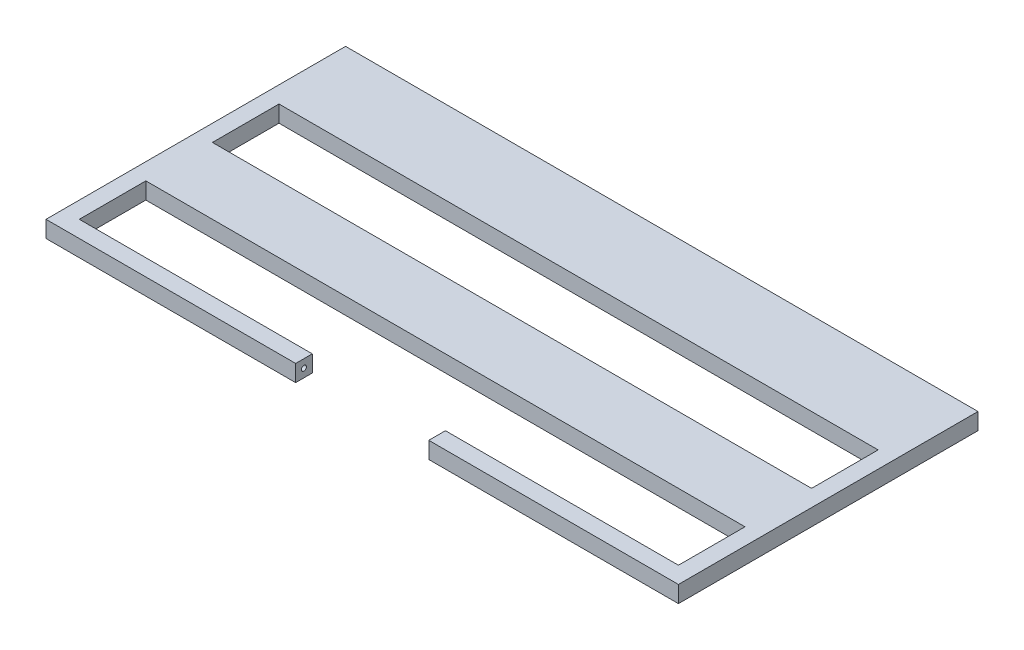
ISO-10303-21;
HEADER;
FILE_DESCRIPTION(('STEP AP214'),'2;1');
FILE_NAME('part.step','',(''),(''),'','','');
FILE_SCHEMA(('AUTOMOTIVE_DESIGN { 1 0 10303 214 1 1 1 1 }'));
ENDSEC;
DATA;
#1=APPLICATION_CONTEXT('core data for automotive mechanical design processes');
#2=APPLICATION_PROTOCOL_DEFINITION('international standard','automotive_design',2000,#1);
#3=PRODUCT_CONTEXT('',#1,'mechanical');
#4=PRODUCT('Part','Part','',(#3));
#5=PRODUCT_RELATED_PRODUCT_CATEGORY('part','',(#4));
#6=PRODUCT_DEFINITION_FORMATION('','',#4);
#7=PRODUCT_DEFINITION_CONTEXT('part definition',#1,'design');
#8=PRODUCT_DEFINITION('design','',#6,#7);
#9=PRODUCT_DEFINITION_SHAPE('','',#8);
#10=(LENGTH_UNIT() NAMED_UNIT(*) SI_UNIT(.MILLI.,.METRE.));
#11=(NAMED_UNIT(*) PLANE_ANGLE_UNIT() SI_UNIT($,.RADIAN.));
#12=(NAMED_UNIT(*) SI_UNIT($,.STERADIAN.) SOLID_ANGLE_UNIT());
#13=UNCERTAINTY_MEASURE_WITH_UNIT(LENGTH_MEASURE(1.E-05),#10,'distance_accuracy_value','');
#14=(GEOMETRIC_REPRESENTATION_CONTEXT(3) GLOBAL_UNCERTAINTY_ASSIGNED_CONTEXT((#13)) GLOBAL_UNIT_ASSIGNED_CONTEXT((#10,
#11,#12)) REPRESENTATION_CONTEXT('',''));
#15=CARTESIAN_POINT('',(0.,0.,0.));
#16=DIRECTION('',(0.,0.,1.));
#17=DIRECTION('',(1.,0.,0.));
#18=AXIS2_PLACEMENT_3D('',#15,#16,#17);
#19=CARTESIAN_POINT('',(0.,25.,475.));
#20=DIRECTION('',(0.,0.,-1.));
#21=DIRECTION('',(-1.,0.,0.));
#22=AXIS2_PLACEMENT_3D('',#19,#20,#21);
#23=PLANE('',#22);
#24=DIRECTION('',(1.,0.,0.));
#25=VECTOR('',#24,1.);
#26=CARTESIAN_POINT('',(0.,0.,475.));
#27=LINE('',#26,#25);
#28=CARTESIAN_POINT('',(-450.,0.,475.));
#29=VERTEX_POINT('',#28);
#30=CARTESIAN_POINT('',(450.,0.,475.));
#31=VERTEX_POINT('',#30);
#32=EDGE_CURVE('E401',#29,#31,#27,.T.);
#33=ORIENTED_EDGE('',*,*,#32,.T.);
#34=DIRECTION('',(0.,-1.,0.));
#35=VECTOR('',#34,1.);
#36=CARTESIAN_POINT('',(450.,25.,475.));
#37=LINE('',#36,#35);
#38=CARTESIAN_POINT('',(450.,25.,475.));
#39=VERTEX_POINT('',#38);
#40=EDGE_CURVE('E240',#39,#31,#37,.T.);
#41=ORIENTED_EDGE('',*,*,#40,.F.);
#42=DIRECTION('',(1.,0.,0.));
#43=VECTOR('',#42,1.);
#44=CARTESIAN_POINT('',(0.,25.,475.));
#45=LINE('',#44,#43);
#46=CARTESIAN_POINT('',(-450.,25.,475.));
#47=VERTEX_POINT('',#46);
#48=EDGE_CURVE('E469',#47,#39,#45,.T.);
#49=ORIENTED_EDGE('',*,*,#48,.F.);
#50=DIRECTION('',(0.,-1.,0.));
#51=VECTOR('',#50,1.);
#52=CARTESIAN_POINT('',(-450.,25.,475.));
#53=LINE('',#52,#51);
#54=EDGE_CURVE('E12',#47,#29,#53,.T.);
#55=ORIENTED_EDGE('',*,*,#54,.T.);
#56=EDGE_LOOP('',(#33,#41,#49,#55));
#57=FACE_BOUND('',#56,.T.);
#58=ADVANCED_FACE('F231',(#57),#23,.F.);
#59=CARTESIAN_POINT('',(0.,25.,375.));
#60=DIRECTION('',(0.,0.,-1.));
#61=DIRECTION('',(-1.,0.,0.));
#62=AXIS2_PLACEMENT_3D('',#59,#60,#61);
#63=PLANE('',#62);
#64=DIRECTION('',(1.,0.,0.));
#65=VECTOR('',#64,1.);
#66=CARTESIAN_POINT('',(0.,0.,375.));
#67=LINE('',#66,#65);
#68=CARTESIAN_POINT('',(-450.,0.,375.));
#69=VERTEX_POINT('',#68);
#70=CARTESIAN_POINT('',(450.,0.,375.));
#71=VERTEX_POINT('',#70);
#72=EDGE_CURVE('E473',#69,#71,#67,.T.);
#73=ORIENTED_EDGE('',*,*,#72,.F.);
#74=DIRECTION('',(0.,-1.,0.));
#75=VECTOR('',#74,1.);
#76=CARTESIAN_POINT('',(-450.,25.,375.));
#77=LINE('',#76,#75);
#78=CARTESIAN_POINT('',(-450.,25.,375.));
#79=VERTEX_POINT('',#78);
#80=EDGE_CURVE('E257',#79,#69,#77,.T.);
#81=ORIENTED_EDGE('',*,*,#80,.F.);
#82=DIRECTION('',(1.,0.,0.));
#83=VECTOR('',#82,1.);
#84=CARTESIAN_POINT('',(0.,25.,375.));
#85=LINE('',#84,#83);
#86=CARTESIAN_POINT('',(450.,25.,375.));
#87=VERTEX_POINT('',#86);
#88=EDGE_CURVE('E472',#79,#87,#85,.T.);
#89=ORIENTED_EDGE('',*,*,#88,.T.);
#90=DIRECTION('',(0.,-1.,0.));
#91=VECTOR('',#90,1.);
#92=CARTESIAN_POINT('',(450.,25.,375.));
#93=LINE('',#92,#91);
#94=EDGE_CURVE('E480',#87,#71,#93,.T.);
#95=ORIENTED_EDGE('',*,*,#94,.T.);
#96=EDGE_LOOP('',(#73,#81,#89,#95));
#97=FACE_BOUND('',#96,.T.);
#98=ADVANCED_FACE('F515',(#97),#63,.T.);
#99=CARTESIAN_POINT('',(0.,0.,0.));
#100=DIRECTION('',(0.,1.,0.));
#101=DIRECTION('',(0.,0.,1.));
#102=AXIS2_PLACEMENT_3D('',#99,#100,#101);
#103=PLANE('',#102);
#104=DIRECTION('',(0.,0.,-1.));
#105=VECTOR('',#104,1.);
#106=CARTESIAN_POINT('',(-450.,0.,575.));
#107=LINE('',#106,#105);
#108=CARTESIAN_POINT('',(-450.,0.,275.));
#109=VERTEX_POINT('',#108);
#110=EDGE_CURVE('E429',#69,#109,#107,.T.);
#111=ORIENTED_EDGE('',*,*,#110,.F.);
#112=ORIENTED_EDGE('',*,*,#72,.T.);
#113=DIRECTION('',(0.,0.,-1.));
#114=VECTOR('',#113,1.);
#115=CARTESIAN_POINT('',(450.,0.,575.));
#116=LINE('',#115,#114);
#117=CARTESIAN_POINT('',(450.,0.,275.));
#118=VERTEX_POINT('',#117);
#119=EDGE_CURVE('E433',#71,#118,#116,.T.);
#120=ORIENTED_EDGE('',*,*,#119,.T.);
#121=DIRECTION('',(1.,0.,0.));
#122=VECTOR('',#121,1.);
#123=CARTESIAN_POINT('',(0.,0.,275.));
#124=LINE('',#123,#122);
#125=EDGE_CURVE('E385',#109,#118,#124,.T.);
#126=ORIENTED_EDGE('',*,*,#125,.F.);
#127=EDGE_LOOP('',(#111,#112,#120,#126));
#128=FACE_BOUND('',#127,.T.);
#129=DIRECTION('',(0.,0.,-1.));
#130=VECTOR('',#129,1.);
#131=CARTESIAN_POINT('',(-475.,0.,600.));
#132=LINE('',#131,#130);
#133=CARTESIAN_POINT('',(-475.,0.,600.));
#134=VERTEX_POINT('',#133);
#135=CARTESIAN_POINT('',(-475.,0.,150.));
#136=VERTEX_POINT('',#135);
#137=EDGE_CURVE('E353',#134,#136,#132,.T.);
#138=ORIENTED_EDGE('',*,*,#137,.T.);
#139=DIRECTION('',(-1.,0.,0.));
#140=VECTOR('',#139,1.);
#141=CARTESIAN_POINT('',(475.,0.,150.));
#142=LINE('',#141,#140);
#143=CARTESIAN_POINT('',(475.,0.,150.));
#144=VERTEX_POINT('',#143);
#145=EDGE_CURVE('E248',#144,#136,#142,.T.);
#146=ORIENTED_EDGE('',*,*,#145,.F.);
#147=DIRECTION('',(0.,0.,-1.));
#148=VECTOR('',#147,1.);
#149=CARTESIAN_POINT('',(475.,0.,600.));
#150=LINE('',#149,#148);
#151=CARTESIAN_POINT('',(475.,0.,600.));
#152=VERTEX_POINT('',#151);
#153=EDGE_CURVE('E362',#152,#144,#150,.T.);
#154=ORIENTED_EDGE('',*,*,#153,.F.);
#155=DIRECTION('',(1.,0.,0.));
#156=VECTOR('',#155,1.);
#157=CARTESIAN_POINT('',(99.9999999999999,0.,600.));
#158=LINE('',#157,#156);
#159=CARTESIAN_POINT('',(99.9999999999999,0.,600.));
#160=VERTEX_POINT('',#159);
#161=EDGE_CURVE('E367',#160,#152,#158,.T.);
#162=ORIENTED_EDGE('',*,*,#161,.F.);
#163=DIRECTION('',(0.,0.,-1.));
#164=VECTOR('',#163,1.);
#165=CARTESIAN_POINT('',(99.9999999999999,0.,600.));
#166=LINE('',#165,#164);
#167=CARTESIAN_POINT('',(99.9999999999998,0.,575.));
#168=VERTEX_POINT('',#167);
#169=EDGE_CURVE('E440',#160,#168,#166,.T.);
#170=ORIENTED_EDGE('',*,*,#169,.T.);
#171=DIRECTION('',(1.,0.,0.));
#172=VECTOR('',#171,1.);
#173=CARTESIAN_POINT('',(99.9999999999998,0.,575.));
#174=LINE('',#173,#172);
#175=CARTESIAN_POINT('',(450.,0.,575.));
#176=VERTEX_POINT('',#175);
#177=EDGE_CURVE('E437',#168,#176,#174,.T.);
#178=ORIENTED_EDGE('',*,*,#177,.T.);
#179=EDGE_CURVE('E434',#176,#31,#116,.T.);
#180=ORIENTED_EDGE('',*,*,#179,.T.);
#181=ORIENTED_EDGE('',*,*,#32,.F.);
#182=CARTESIAN_POINT('',(-450.,0.,575.));
#183=VERTEX_POINT('',#182);
#184=EDGE_CURVE('E430',#183,#29,#107,.T.);
#185=ORIENTED_EDGE('',*,*,#184,.F.);
#186=DIRECTION('',(1.,0.,0.));
#187=VECTOR('',#186,1.);
#188=CARTESIAN_POINT('',(-450.,0.,575.));
#189=LINE('',#188,#187);
#190=CARTESIAN_POINT('',(-100.,0.,575.));
#191=VERTEX_POINT('',#190);
#192=EDGE_CURVE('E427',#183,#191,#189,.T.);
#193=ORIENTED_EDGE('',*,*,#192,.T.);
#194=DIRECTION('',(0.,0.,-1.));
#195=VECTOR('',#194,1.);
#196=CARTESIAN_POINT('',(-100.,0.,600.));
#197=LINE('',#196,#195);
#198=CARTESIAN_POINT('',(-100.,0.,600.));
#199=VERTEX_POINT('',#198);
#200=EDGE_CURVE('E356',#199,#191,#197,.T.);
#201=ORIENTED_EDGE('',*,*,#200,.F.);
#202=DIRECTION('',(1.,0.,0.));
#203=VECTOR('',#202,1.);
#204=CARTESIAN_POINT('',(-475.,0.,600.));
#205=LINE('',#204,#203);
#206=EDGE_CURVE('E340',#134,#199,#205,.T.);
#207=ORIENTED_EDGE('',*,*,#206,.F.);
#208=EDGE_LOOP('',(#138,#146,#154,#162,#170,#178,#180,#181,#185,#193,#201,#207));
#209=FACE_BOUND('',#208,.T.);
#210=ADVANCED_FACE('F352',(#128,#209),#103,.F.);
#211=CARTESIAN_POINT('',(0.,25.,0.));
#212=DIRECTION('',(0.,1.,0.));
#213=DIRECTION('',(0.,0.,1.));
#214=AXIS2_PLACEMENT_3D('',#211,#212,#213);
#215=PLANE('',#214);
#216=DIRECTION('',(1.,0.,0.));
#217=VECTOR('',#216,1.);
#218=CARTESIAN_POINT('',(475.,25.,150.));
#219=LINE('',#218,#217);
#220=CARTESIAN_POINT('',(-475.,25.,150.));
#221=VERTEX_POINT('',#220);
#222=CARTESIAN_POINT('',(475.,25.,150.));
#223=VERTEX_POINT('',#222);
#224=EDGE_CURVE('E458',#221,#223,#219,.T.);
#225=ORIENTED_EDGE('',*,*,#224,.F.);
#226=DIRECTION('',(0.,0.,-1.));
#227=VECTOR('',#226,1.);
#228=CARTESIAN_POINT('',(-475.,25.,600.));
#229=LINE('',#228,#227);
#230=CARTESIAN_POINT('',(-475.,25.,600.));
#231=VERTEX_POINT('',#230);
#232=EDGE_CURVE('E348',#231,#221,#229,.T.);
#233=ORIENTED_EDGE('',*,*,#232,.F.);
#234=DIRECTION('',(1.,0.,0.));
#235=VECTOR('',#234,1.);
#236=CARTESIAN_POINT('',(-475.,25.,600.));
#237=LINE('',#236,#235);
#238=CARTESIAN_POINT('',(-100.,25.,600.));
#239=VERTEX_POINT('',#238);
#240=EDGE_CURVE('E342',#231,#239,#237,.T.);
#241=ORIENTED_EDGE('',*,*,#240,.T.);
#242=DIRECTION('',(0.,0.,-1.));
#243=VECTOR('',#242,1.);
#244=CARTESIAN_POINT('',(-100.,25.,600.));
#245=LINE('',#244,#243);
#246=CARTESIAN_POINT('',(-100.,25.,575.));
#247=VERTEX_POINT('',#246);
#248=EDGE_CURVE('E364',#239,#247,#245,.T.);
#249=ORIENTED_EDGE('',*,*,#248,.T.);
#250=DIRECTION('',(1.,0.,0.));
#251=VECTOR('',#250,1.);
#252=CARTESIAN_POINT('',(-450.,25.,575.));
#253=LINE('',#252,#251);
#254=CARTESIAN_POINT('',(-450.,25.,575.));
#255=VERTEX_POINT('',#254);
#256=EDGE_CURVE('E404',#255,#247,#253,.T.);
#257=ORIENTED_EDGE('',*,*,#256,.F.);
#258=DIRECTION('',(0.,0.,-1.));
#259=VECTOR('',#258,1.);
#260=CARTESIAN_POINT('',(-450.,25.,575.));
#261=LINE('',#260,#259);
#262=EDGE_CURVE('E407',#255,#47,#261,.T.);
#263=ORIENTED_EDGE('',*,*,#262,.T.);
#264=ORIENTED_EDGE('',*,*,#48,.T.);
#265=DIRECTION('',(0.,0.,-1.));
#266=VECTOR('',#265,1.);
#267=CARTESIAN_POINT('',(450.,25.,575.));
#268=LINE('',#267,#266);
#269=CARTESIAN_POINT('',(450.,25.,575.));
#270=VERTEX_POINT('',#269);
#271=EDGE_CURVE('E411',#270,#39,#268,.T.);
#272=ORIENTED_EDGE('',*,*,#271,.F.);
#273=DIRECTION('',(1.,0.,0.));
#274=VECTOR('',#273,1.);
#275=CARTESIAN_POINT('',(99.9999999999998,25.,575.));
#276=LINE('',#275,#274);
#277=CARTESIAN_POINT('',(99.9999999999998,25.,575.));
#278=VERTEX_POINT('',#277);
#279=EDGE_CURVE('E414',#278,#270,#276,.T.);
#280=ORIENTED_EDGE('',*,*,#279,.F.);
#281=DIRECTION('',(0.,0.,-1.));
#282=VECTOR('',#281,1.);
#283=CARTESIAN_POINT('',(99.9999999999999,25.,600.));
#284=LINE('',#283,#282);
#285=CARTESIAN_POINT('',(99.9999999999999,25.,600.));
#286=VERTEX_POINT('',#285);
#287=EDGE_CURVE('E417',#286,#278,#284,.T.);
#288=ORIENTED_EDGE('',*,*,#287,.F.);
#289=DIRECTION('',(1.,0.,0.));
#290=VECTOR('',#289,1.);
#291=CARTESIAN_POINT('',(99.9999999999999,25.,600.));
#292=LINE('',#291,#290);
#293=CARTESIAN_POINT('',(475.,25.,600.));
#294=VERTEX_POINT('',#293);
#295=EDGE_CURVE('E420',#286,#294,#292,.T.);
#296=ORIENTED_EDGE('',*,*,#295,.T.);
#297=DIRECTION('',(0.,0.,-1.));
#298=VECTOR('',#297,1.);
#299=CARTESIAN_POINT('',(475.,25.,600.));
#300=LINE('',#299,#298);
#301=EDGE_CURVE('E422',#294,#223,#300,.T.);
#302=ORIENTED_EDGE('',*,*,#301,.T.);
#303=EDGE_LOOP('',(#225,#233,#241,#249,#257,#263,#264,#272,#280,#288,#296,#302));
#304=FACE_BOUND('',#303,.T.);
#305=ORIENTED_EDGE('',*,*,#88,.F.);
#306=CARTESIAN_POINT('',(-450.,25.,275.));
#307=VERTEX_POINT('',#306);
#308=EDGE_CURVE('E406',#79,#307,#261,.T.);
#309=ORIENTED_EDGE('',*,*,#308,.T.);
#310=DIRECTION('',(1.,0.,0.));
#311=VECTOR('',#310,1.);
#312=CARTESIAN_POINT('',(0.,25.,275.));
#313=LINE('',#312,#311);
#314=CARTESIAN_POINT('',(450.,25.,275.));
#315=VERTEX_POINT('',#314);
#316=EDGE_CURVE('E388',#307,#315,#313,.T.);
#317=ORIENTED_EDGE('',*,*,#316,.T.);
#318=EDGE_CURVE('E410',#87,#315,#268,.T.);
#319=ORIENTED_EDGE('',*,*,#318,.F.);
#320=EDGE_LOOP('',(#305,#309,#317,#319));
#321=FACE_BOUND('',#320,.T.);
#322=ADVANCED_FACE('F500',(#304,#321),#215,.T.);
#323=CARTESIAN_POINT('',(0.,25.,275.));
#324=DIRECTION('',(0.,0.,-1.));
#325=DIRECTION('',(-1.,0.,0.));
#326=AXIS2_PLACEMENT_3D('',#323,#324,#325);
#327=PLANE('',#326);
#328=ORIENTED_EDGE('',*,*,#125,.T.);
#329=DIRECTION('',(0.,-1.,0.));
#330=VECTOR('',#329,1.);
#331=CARTESIAN_POINT('',(450.,25.,275.));
#332=LINE('',#331,#330);
#333=EDGE_CURVE('E395',#315,#118,#332,.T.);
#334=ORIENTED_EDGE('',*,*,#333,.F.);
#335=ORIENTED_EDGE('',*,*,#316,.F.);
#336=DIRECTION('',(0.,-1.,0.));
#337=VECTOR('',#336,1.);
#338=CARTESIAN_POINT('',(-450.,25.,275.));
#339=LINE('',#338,#337);
#340=EDGE_CURVE('E400',#307,#109,#339,.T.);
#341=ORIENTED_EDGE('',*,*,#340,.T.);
#342=EDGE_LOOP('',(#328,#334,#335,#341));
#343=FACE_BOUND('',#342,.T.);
#344=ADVANCED_FACE('F504',(#343),#327,.F.);
#345=CARTESIAN_POINT('',(-100.,25.,600.));
#346=DIRECTION('',(-1.,0.,0.));
#347=DIRECTION('',(0.,0.,1.));
#348=AXIS2_PLACEMENT_3D('',#345,#346,#347);
#349=PLANE('',#348);
#350=CARTESIAN_POINT('',(-100.,12.5000000000001,587.5));
#351=DIRECTION('',(1.,0.,0.));
#352=DIRECTION('',(0.,0.,-1.));
#353=AXIS2_PLACEMENT_3D('',#350,#351,#352);
#354=CIRCLE('',#353,3.74999999999998);
#355=CARTESIAN_POINT('',(-100.,12.5000000000001,583.75));
#356=VERTEX_POINT('',#355);
#357=EDGE_CURVE('E464',#356,#356,#354,.T.);
#358=ORIENTED_EDGE('',*,*,#357,.F.);
#359=EDGE_LOOP('',(#358));
#360=FACE_BOUND('',#359,.T.);
#361=ORIENTED_EDGE('',*,*,#200,.T.);
#362=DIRECTION('',(0.,-1.,0.));
#363=VECTOR('',#362,1.);
#364=CARTESIAN_POINT('',(-100.,25.,575.));
#365=LINE('',#364,#363);
#366=EDGE_CURVE('E380',#247,#191,#365,.T.);
#367=ORIENTED_EDGE('',*,*,#366,.F.);
#368=ORIENTED_EDGE('',*,*,#248,.F.);
#369=DIRECTION('',(0.,-1.,0.));
#370=VECTOR('',#369,1.);
#371=CARTESIAN_POINT('',(-100.,25.,600.));
#372=LINE('',#371,#370);
#373=EDGE_CURVE('E235',#239,#199,#372,.T.);
#374=ORIENTED_EDGE('',*,*,#373,.T.);
#375=EDGE_LOOP('',(#361,#367,#368,#374));
#376=FACE_BOUND('',#375,.T.);
#377=ADVANCED_FACE('F502',(#360,#376),#349,.F.);
#378=CARTESIAN_POINT('',(-450.,25.,575.));
#379=DIRECTION('',(0.,0.,-1.));
#380=DIRECTION('',(-1.,0.,0.));
#381=AXIS2_PLACEMENT_3D('',#378,#379,#380);
#382=PLANE('',#381);
#383=ORIENTED_EDGE('',*,*,#192,.F.);
#384=DIRECTION('',(0.,-1.,0.));
#385=VECTOR('',#384,1.);
#386=CARTESIAN_POINT('',(-450.,25.,575.));
#387=LINE('',#386,#385);
#388=EDGE_CURVE('E379',#255,#183,#387,.T.);
#389=ORIENTED_EDGE('',*,*,#388,.F.);
#390=ORIENTED_EDGE('',*,*,#256,.T.);
#391=ORIENTED_EDGE('',*,*,#366,.T.);
#392=EDGE_LOOP('',(#383,#389,#390,#391));
#393=FACE_BOUND('',#392,.T.);
#394=ADVANCED_FACE('F496',(#393),#382,.T.);
#395=CARTESIAN_POINT('',(-450.,25.,575.));
#396=DIRECTION('',(-1.,0.,0.));
#397=DIRECTION('',(0.,0.,1.));
#398=AXIS2_PLACEMENT_3D('',#395,#396,#397);
#399=PLANE('',#398);
#400=ORIENTED_EDGE('',*,*,#184,.T.);
#401=ORIENTED_EDGE('',*,*,#54,.F.);
#402=ORIENTED_EDGE('',*,*,#262,.F.);
#403=ORIENTED_EDGE('',*,*,#388,.T.);
#404=EDGE_LOOP('',(#400,#401,#402,#403));
#405=FACE_BOUND('',#404,.T.);
#406=ADVANCED_FACE('F495',(#405),#399,.F.);
#407=ORIENTED_EDGE('',*,*,#80,.T.);
#408=ORIENTED_EDGE('',*,*,#110,.T.);
#409=ORIENTED_EDGE('',*,*,#340,.F.);
#410=ORIENTED_EDGE('',*,*,#308,.F.);
#411=EDGE_LOOP('',(#407,#408,#409,#410));
#412=FACE_BOUND('',#411,.T.);
#413=ADVANCED_FACE('F511',(#412),#399,.F.);
#414=CARTESIAN_POINT('',(450.,25.,575.));
#415=DIRECTION('',(-1.,0.,0.));
#416=DIRECTION('',(0.,0.,1.));
#417=AXIS2_PLACEMENT_3D('',#414,#415,#416);
#418=PLANE('',#417);
#419=ORIENTED_EDGE('',*,*,#119,.F.);
#420=ORIENTED_EDGE('',*,*,#94,.F.);
#421=ORIENTED_EDGE('',*,*,#318,.T.);
#422=ORIENTED_EDGE('',*,*,#333,.T.);
#423=EDGE_LOOP('',(#419,#420,#421,#422));
#424=FACE_BOUND('',#423,.T.);
#425=ADVANCED_FACE('F537',(#424),#418,.T.);
#426=ORIENTED_EDGE('',*,*,#271,.T.);
#427=ORIENTED_EDGE('',*,*,#40,.T.);
#428=ORIENTED_EDGE('',*,*,#179,.F.);
#429=DIRECTION('',(0.,-1.,0.));
#430=VECTOR('',#429,1.);
#431=CARTESIAN_POINT('',(450.,25.,575.));
#432=LINE('',#431,#430);
#433=EDGE_CURVE('E377',#270,#176,#432,.T.);
#434=ORIENTED_EDGE('',*,*,#433,.F.);
#435=EDGE_LOOP('',(#426,#427,#428,#434));
#436=FACE_BOUND('',#435,.T.);
#437=ADVANCED_FACE('F485',(#436),#418,.T.);
#438=CARTESIAN_POINT('',(99.9999999999998,25.,575.));
#439=DIRECTION('',(0.,0.,-1.));
#440=DIRECTION('',(-1.,0.,0.));
#441=AXIS2_PLACEMENT_3D('',#438,#439,#440);
#442=PLANE('',#441);
#443=ORIENTED_EDGE('',*,*,#177,.F.);
#444=DIRECTION('',(0.,-1.,0.));
#445=VECTOR('',#444,1.);
#446=CARTESIAN_POINT('',(99.9999999999998,25.,575.));
#447=LINE('',#446,#445);
#448=EDGE_CURVE('E375',#278,#168,#447,.T.);
#449=ORIENTED_EDGE('',*,*,#448,.F.);
#450=ORIENTED_EDGE('',*,*,#279,.T.);
#451=ORIENTED_EDGE('',*,*,#433,.T.);
#452=EDGE_LOOP('',(#443,#449,#450,#451));
#453=FACE_BOUND('',#452,.T.);
#454=ADVANCED_FACE('F532',(#453),#442,.T.);
#455=CARTESIAN_POINT('',(99.9999999999999,25.,600.));
#456=DIRECTION('',(-1.,0.,0.));
#457=DIRECTION('',(0.,0.,1.));
#458=AXIS2_PLACEMENT_3D('',#455,#456,#457);
#459=PLANE('',#458);
#460=ORIENTED_EDGE('',*,*,#169,.F.);
#461=DIRECTION('',(0.,-1.,0.));
#462=VECTOR('',#461,1.);
#463=CARTESIAN_POINT('',(99.9999999999999,25.,600.));
#464=LINE('',#463,#462);
#465=EDGE_CURVE('E373',#286,#160,#464,.T.);
#466=ORIENTED_EDGE('',*,*,#465,.F.);
#467=ORIENTED_EDGE('',*,*,#287,.T.);
#468=ORIENTED_EDGE('',*,*,#448,.T.);
#469=EDGE_LOOP('',(#460,#466,#467,#468));
#470=FACE_BOUND('',#469,.T.);
#471=ADVANCED_FACE('F529',(#470),#459,.T.);
#472=CARTESIAN_POINT('',(99.9999999999999,25.,600.));
#473=DIRECTION('',(0.,0.,-1.));
#474=DIRECTION('',(-1.,0.,0.));
#475=AXIS2_PLACEMENT_3D('',#472,#473,#474);
#476=PLANE('',#475);
#477=ORIENTED_EDGE('',*,*,#161,.T.);
#478=DIRECTION('',(0.,-1.,0.));
#479=VECTOR('',#478,1.);
#480=CARTESIAN_POINT('',(475.,25.,600.));
#481=LINE('',#480,#479);
#482=EDGE_CURVE('E347',#294,#152,#481,.T.);
#483=ORIENTED_EDGE('',*,*,#482,.F.);
#484=ORIENTED_EDGE('',*,*,#295,.F.);
#485=ORIENTED_EDGE('',*,*,#465,.T.);
#486=EDGE_LOOP('',(#477,#483,#484,#485));
#487=FACE_BOUND('',#486,.T.);
#488=ADVANCED_FACE('F445',(#487),#476,.F.);
#489=CARTESIAN_POINT('',(475.,25.,600.));
#490=DIRECTION('',(-1.,0.,0.));
#491=DIRECTION('',(0.,0.,1.));
#492=AXIS2_PLACEMENT_3D('',#489,#490,#491);
#493=PLANE('',#492);
#494=ORIENTED_EDGE('',*,*,#153,.T.);
#495=DIRECTION('',(0.,-1.,0.));
#496=VECTOR('',#495,1.);
#497=CARTESIAN_POINT('',(475.,0.,150.));
#498=LINE('',#497,#496);
#499=EDGE_CURVE('E456',#223,#144,#498,.T.);
#500=ORIENTED_EDGE('',*,*,#499,.F.);
#501=ORIENTED_EDGE('',*,*,#301,.F.);
#502=ORIENTED_EDGE('',*,*,#482,.T.);
#503=EDGE_LOOP('',(#494,#500,#501,#502));
#504=FACE_BOUND('',#503,.T.);
#505=ADVANCED_FACE('F451',(#504),#493,.F.);
#506=CARTESIAN_POINT('',(-475.,25.,600.));
#507=DIRECTION('',(-1.,0.,0.));
#508=DIRECTION('',(0.,0.,1.));
#509=AXIS2_PLACEMENT_3D('',#506,#507,#508);
#510=PLANE('',#509);
#511=DIRECTION('',(0.,1.,0.));
#512=VECTOR('',#511,1.);
#513=CARTESIAN_POINT('',(-475.,0.,150.));
#514=LINE('',#513,#512);
#515=EDGE_CURVE('E361',#136,#221,#514,.T.);
#516=ORIENTED_EDGE('',*,*,#515,.F.);
#517=ORIENTED_EDGE('',*,*,#137,.F.);
#518=DIRECTION('',(0.,-1.,0.));
#519=VECTOR('',#518,1.);
#520=CARTESIAN_POINT('',(-475.,25.,600.));
#521=LINE('',#520,#519);
#522=EDGE_CURVE('E337',#231,#134,#521,.T.);
#523=ORIENTED_EDGE('',*,*,#522,.F.);
#524=ORIENTED_EDGE('',*,*,#232,.T.);
#525=EDGE_LOOP('',(#516,#517,#523,#524));
#526=FACE_BOUND('',#525,.T.);
#527=ADVANCED_FACE('F360',(#526),#510,.T.);
#528=CARTESIAN_POINT('',(-475.,25.,600.));
#529=DIRECTION('',(0.,0.,-1.));
#530=DIRECTION('',(-1.,0.,0.));
#531=AXIS2_PLACEMENT_3D('',#528,#529,#530);
#532=PLANE('',#531);
#533=ORIENTED_EDGE('',*,*,#206,.T.);
#534=ORIENTED_EDGE('',*,*,#373,.F.);
#535=ORIENTED_EDGE('',*,*,#240,.F.);
#536=ORIENTED_EDGE('',*,*,#522,.T.);
#537=EDGE_LOOP('',(#533,#534,#535,#536));
#538=FACE_BOUND('',#537,.T.);
#539=ADVANCED_FACE('F233',(#538),#532,.F.);
#540=CARTESIAN_POINT('',(-110.,12.5000000000001,587.5));
#541=DIRECTION('',(1.,0.,0.));
#542=DIRECTION('',(0.,0.,-1.));
#543=AXIS2_PLACEMENT_3D('',#540,#541,#542);
#544=CYLINDRICAL_SURFACE('',#543,3.74999999999998);
#545=CARTESIAN_POINT('',(-110.,12.5000000000001,587.5));
#546=DIRECTION('',(1.,0.,0.));
#547=DIRECTION('',(0.,0.,-1.));
#548=AXIS2_PLACEMENT_3D('',#545,#546,#547);
#549=CIRCLE('',#548,3.74999999999998);
#550=CARTESIAN_POINT('',(-110.,12.5000000000001,583.75));
#551=VERTEX_POINT('',#550);
#552=EDGE_CURVE('E358',#551,#551,#549,.T.);
#553=ORIENTED_EDGE('',*,*,#552,.F.);
#554=EDGE_LOOP('',(#553));
#555=FACE_BOUND('',#554,.T.);
#556=ORIENTED_EDGE('',*,*,#357,.T.);
#557=EDGE_LOOP('',(#556));
#558=FACE_BOUND('',#557,.T.);
#559=ADVANCED_FACE('F552',(#555,#558),#544,.F.);
#560=CARTESIAN_POINT('',(-110.,0.,0.));
#561=DIRECTION('',(1.,0.,0.));
#562=DIRECTION('',(0.,0.,-1.));
#563=AXIS2_PLACEMENT_3D('',#560,#561,#562);
#564=PLANE('',#563);
#565=ORIENTED_EDGE('',*,*,#552,.T.);
#566=EDGE_LOOP('',(#565));
#567=FACE_BOUND('',#566,.T.);
#568=ADVANCED_FACE('F555',(#567),#564,.T.);
#569=CARTESIAN_POINT('',(0.,0.,150.));
#570=DIRECTION('',(0.,0.,1.));
#571=DIRECTION('',(1.,0.,0.));
#572=AXIS2_PLACEMENT_3D('',#569,#570,#571);
#573=PLANE('',#572);
#574=ORIENTED_EDGE('',*,*,#499,.T.);
#575=ORIENTED_EDGE('',*,*,#145,.T.);
#576=ORIENTED_EDGE('',*,*,#515,.T.);
#577=ORIENTED_EDGE('',*,*,#224,.T.);
#578=EDGE_LOOP('',(#574,#575,#576,#577));
#579=FACE_BOUND('',#578,.T.);
#580=ADVANCED_FACE('F559',(#579),#573,.F.);
#581=CLOSED_SHELL('',(#58,#98,#210,#322,#344,#377,#394,#406,#413,#425,#437,#454,#471,#488,#505,
#527,#539,#559,#568,#580));
#582=MANIFOLD_SOLID_BREP('B2',#581);
#583=ADVANCED_BREP_SHAPE_REPRESENTATION('',(#18,#582),#14);
#584=SHAPE_DEFINITION_REPRESENTATION(#9,#583);
ENDSEC;
END-ISO-10303-21;
